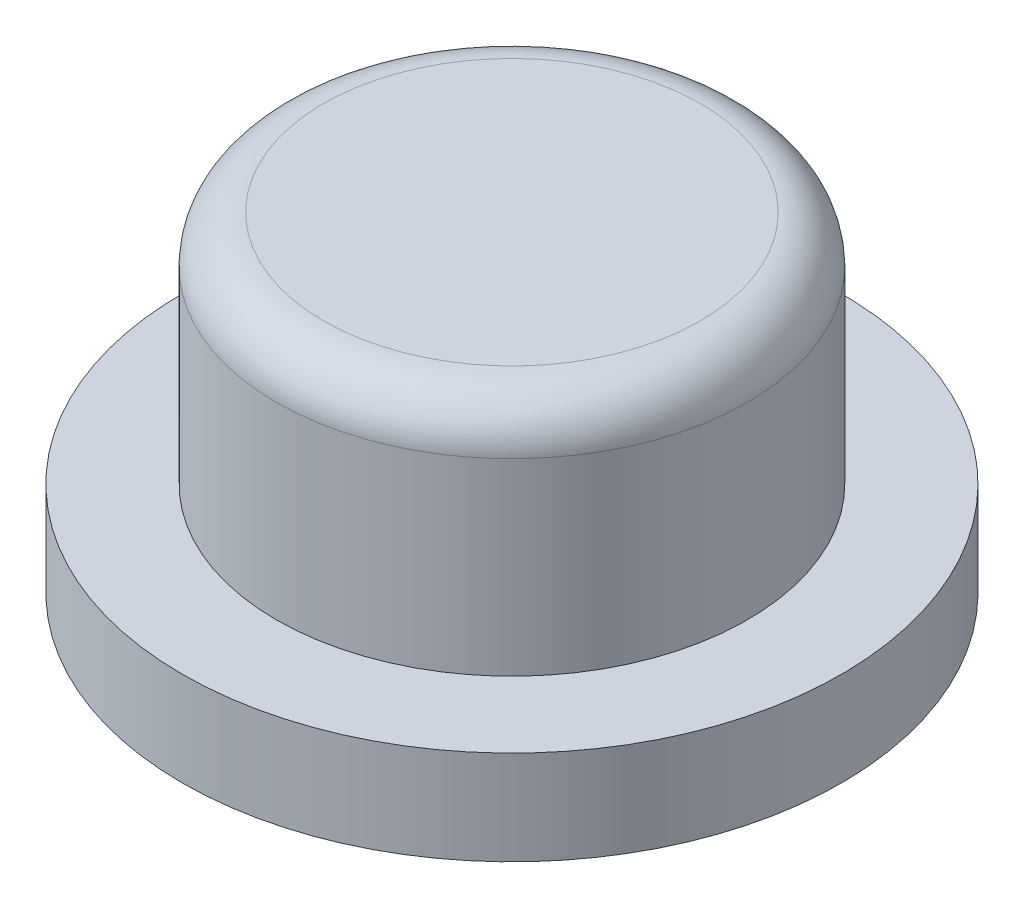
ISO-10303-21;
HEADER;
FILE_DESCRIPTION(('STEP AP214'),'2;1');
FILE_NAME('part.step','',(''),(''),'','','');
FILE_SCHEMA(('AUTOMOTIVE_DESIGN { 1 0 10303 214 1 1 1 1 }'));
ENDSEC;
DATA;
#1=APPLICATION_CONTEXT('core data for automotive mechanical design processes');
#2=APPLICATION_PROTOCOL_DEFINITION('international standard','automotive_design',2000,#1);
#3=PRODUCT_CONTEXT('',#1,'mechanical');
#4=PRODUCT('Part','Part','',(#3));
#5=PRODUCT_RELATED_PRODUCT_CATEGORY('part','',(#4));
#6=PRODUCT_DEFINITION_FORMATION('','',#4);
#7=PRODUCT_DEFINITION_CONTEXT('part definition',#1,'design');
#8=PRODUCT_DEFINITION('design','',#6,#7);
#9=PRODUCT_DEFINITION_SHAPE('','',#8);
#10=(LENGTH_UNIT() NAMED_UNIT(*) SI_UNIT(.MILLI.,.METRE.));
#11=(NAMED_UNIT(*) PLANE_ANGLE_UNIT() SI_UNIT($,.RADIAN.));
#12=(NAMED_UNIT(*) SI_UNIT($,.STERADIAN.) SOLID_ANGLE_UNIT());
#13=UNCERTAINTY_MEASURE_WITH_UNIT(LENGTH_MEASURE(1.E-05),#10,'distance_accuracy_value','');
#14=(GEOMETRIC_REPRESENTATION_CONTEXT(3) GLOBAL_UNCERTAINTY_ASSIGNED_CONTEXT((#13)) GLOBAL_UNIT_ASSIGNED_CONTEXT((#10,
#11,#12)) REPRESENTATION_CONTEXT('',''));
#15=CARTESIAN_POINT('',(0.,0.,0.));
#16=DIRECTION('',(0.,0.,1.));
#17=DIRECTION('',(1.,0.,0.));
#18=AXIS2_PLACEMENT_3D('',#15,#16,#17);
#19=CARTESIAN_POINT('',(0.,2.,0.));
#20=DIRECTION('',(0.,1.,0.));
#21=DIRECTION('',(0.,0.,1.));
#22=AXIS2_PLACEMENT_3D('',#19,#20,#21);
#23=PLANE('',#22);
#24=CARTESIAN_POINT('',(0.,2.,0.));
#25=DIRECTION('',(0.,1.,0.));
#26=DIRECTION('',(0.,0.,1.));
#27=AXIS2_PLACEMENT_3D('',#24,#25,#26);
#28=CIRCLE('',#27,7.);
#29=CARTESIAN_POINT('',(0.,2.,7.));
#30=VERTEX_POINT('',#29);
#31=EDGE_CURVE('E44',#30,#30,#28,.T.);
#32=ORIENTED_EDGE('',*,*,#31,.T.);
#33=EDGE_LOOP('',(#32));
#34=FACE_BOUND('',#33,.T.);
#35=CARTESIAN_POINT('',(0.,2.,0.));
#36=DIRECTION('',(0.,1.,0.));
#37=DIRECTION('',(0.,0.,1.));
#38=AXIS2_PLACEMENT_3D('',#35,#36,#37);
#39=CIRCLE('',#38,5.);
#40=CARTESIAN_POINT('',(0.,2.,5.));
#41=VERTEX_POINT('',#40);
#42=EDGE_CURVE('E52',#41,#41,#39,.T.);
#43=ORIENTED_EDGE('',*,*,#42,.F.);
#44=EDGE_LOOP('',(#43));
#45=FACE_BOUND('',#44,.T.);
#46=ADVANCED_FACE('F33',(#34,#45),#23,.T.);
#47=CARTESIAN_POINT('',(0.,2.,0.));
#48=DIRECTION('',(0.,-1.,0.));
#49=DIRECTION('',(0.,0.,-1.));
#50=AXIS2_PLACEMENT_3D('',#47,#48,#49);
#51=CYLINDRICAL_SURFACE('',#50,7.);
#52=ORIENTED_EDGE('',*,*,#31,.F.);
#53=EDGE_LOOP('',(#52));
#54=FACE_BOUND('',#53,.T.);
#55=CARTESIAN_POINT('',(0.,0.,0.));
#56=DIRECTION('',(0.,1.,0.));
#57=DIRECTION('',(0.,0.,1.));
#58=AXIS2_PLACEMENT_3D('',#55,#56,#57);
#59=CIRCLE('',#58,7.);
#60=CARTESIAN_POINT('',(0.,0.,7.));
#61=VERTEX_POINT('',#60);
#62=EDGE_CURVE('E48',#61,#61,#59,.T.);
#63=ORIENTED_EDGE('',*,*,#62,.T.);
#64=EDGE_LOOP('',(#63));
#65=FACE_BOUND('',#64,.T.);
#66=ADVANCED_FACE('F76',(#54,#65),#51,.T.);
#67=CARTESIAN_POINT('',(0.,0.,0.));
#68=DIRECTION('',(0.,1.,0.));
#69=DIRECTION('',(0.,0.,1.));
#70=AXIS2_PLACEMENT_3D('',#67,#68,#69);
#71=PLANE('',#70);
#72=CARTESIAN_POINT('',(0.,0.,0.));
#73=DIRECTION('',(0.,-1.,0.));
#74=DIRECTION('',(0.,0.,-1.));
#75=AXIS2_PLACEMENT_3D('',#72,#73,#74);
#76=CIRCLE('',#75,2.5);
#77=CARTESIAN_POINT('',(0.,0.,-2.5));
#78=VERTEX_POINT('',#77);
#79=EDGE_CURVE('E57',#78,#78,#76,.T.);
#80=ORIENTED_EDGE('',*,*,#79,.F.);
#81=EDGE_LOOP('',(#80));
#82=FACE_BOUND('',#81,.T.);
#83=ORIENTED_EDGE('',*,*,#62,.F.);
#84=EDGE_LOOP('',(#83));
#85=FACE_BOUND('',#84,.T.);
#86=ADVANCED_FACE('F72',(#82,#85),#71,.F.);
#87=CARTESIAN_POINT('',(0.,7.,0.));
#88=DIRECTION('',(0.,-1.,0.));
#89=DIRECTION('',(0.,0.,-1.));
#90=AXIS2_PLACEMENT_3D('',#87,#88,#89);
#91=CYLINDRICAL_SURFACE('',#90,5.);
#92=CARTESIAN_POINT('',(0.,6.,0.));
#93=DIRECTION('',(0.,1.,0.));
#94=DIRECTION('',(0.,0.,1.));
#95=AXIS2_PLACEMENT_3D('',#92,#93,#94);
#96=CIRCLE('',#95,5.);
#97=CARTESIAN_POINT('',(0.,6.,5.));
#98=VERTEX_POINT('',#97);
#99=EDGE_CURVE('E10',#98,#98,#96,.F.);
#100=ORIENTED_EDGE('',*,*,#99,.T.);
#101=EDGE_LOOP('',(#100));
#102=FACE_BOUND('',#101,.T.);
#103=ORIENTED_EDGE('',*,*,#42,.T.);
#104=EDGE_LOOP('',(#103));
#105=FACE_BOUND('',#104,.T.);
#106=ADVANCED_FACE('F75',(#102,#105),#91,.T.);
#107=CARTESIAN_POINT('',(0.,7.,0.));
#108=DIRECTION('',(0.,1.,0.));
#109=DIRECTION('',(0.,0.,1.));
#110=AXIS2_PLACEMENT_3D('',#107,#108,#109);
#111=PLANE('',#110);
#112=CARTESIAN_POINT('',(0.,7.,0.));
#113=DIRECTION('',(0.,1.,0.));
#114=DIRECTION('',(0.,0.,1.));
#115=AXIS2_PLACEMENT_3D('',#112,#113,#114);
#116=CIRCLE('',#115,4.);
#117=CARTESIAN_POINT('',(0.,7.,4.));
#118=VERTEX_POINT('',#117);
#119=EDGE_CURVE('E40',#118,#118,#116,.T.);
#120=ORIENTED_EDGE('',*,*,#119,.T.);
#121=EDGE_LOOP('',(#120));
#122=FACE_BOUND('',#121,.T.);
#123=ADVANCED_FACE('F68',(#122),#111,.T.);
#124=CARTESIAN_POINT('',(0.,5.,0.));
#125=DIRECTION('',(0.,-1.,0.));
#126=DIRECTION('',(0.,0.,-1.));
#127=AXIS2_PLACEMENT_3D('',#124,#125,#126);
#128=CYLINDRICAL_SURFACE('',#127,2.5);
#129=CARTESIAN_POINT('',(0.,5.,0.));
#130=DIRECTION('',(0.,-1.,0.));
#131=DIRECTION('',(0.,0.,-1.));
#132=AXIS2_PLACEMENT_3D('',#129,#130,#131);
#133=CIRCLE('',#132,2.5);
#134=CARTESIAN_POINT('',(0.,5.,-2.5));
#135=VERTEX_POINT('',#134);
#136=EDGE_CURVE('E56',#135,#135,#133,.T.);
#137=ORIENTED_EDGE('',*,*,#136,.F.);
#138=EDGE_LOOP('',(#137));
#139=FACE_BOUND('',#138,.T.);
#140=ORIENTED_EDGE('',*,*,#79,.T.);
#141=EDGE_LOOP('',(#140));
#142=FACE_BOUND('',#141,.T.);
#143=ADVANCED_FACE('F65',(#139,#142),#128,.F.);
#144=CARTESIAN_POINT('',(0.,5.,0.));
#145=DIRECTION('',(0.,-1.,0.));
#146=DIRECTION('',(0.,0.,-1.));
#147=AXIS2_PLACEMENT_3D('',#144,#145,#146);
#148=PLANE('',#147);
#149=ORIENTED_EDGE('',*,*,#136,.T.);
#150=EDGE_LOOP('',(#149));
#151=FACE_BOUND('',#150,.T.);
#152=ADVANCED_FACE('F63',(#151),#148,.T.);
#153=CARTESIAN_POINT('',(0.,6.,0.));
#154=DIRECTION('',(0.,1.,0.));
#155=DIRECTION('',(0.,0.,1.));
#156=AXIS2_PLACEMENT_3D('',#153,#154,#155);
#157=TOROIDAL_SURFACE('',#156,4.,1.);
#158=ORIENTED_EDGE('',*,*,#99,.F.);
#159=EDGE_LOOP('',(#158));
#160=FACE_BOUND('',#159,.T.);
#161=ORIENTED_EDGE('',*,*,#119,.F.);
#162=EDGE_LOOP('',(#161));
#163=FACE_BOUND('',#162,.T.);
#164=ADVANCED_FACE('F35',(#160,#163),#157,.T.);
#165=CLOSED_SHELL('',(#46,#66,#86,#106,#123,#143,#152,#164));
#166=MANIFOLD_SOLID_BREP('B2',#165);
#167=ADVANCED_BREP_SHAPE_REPRESENTATION('',(#18,#166),#14);
#168=SHAPE_DEFINITION_REPRESENTATION(#9,#167);
ENDSEC;
END-ISO-10303-21;
